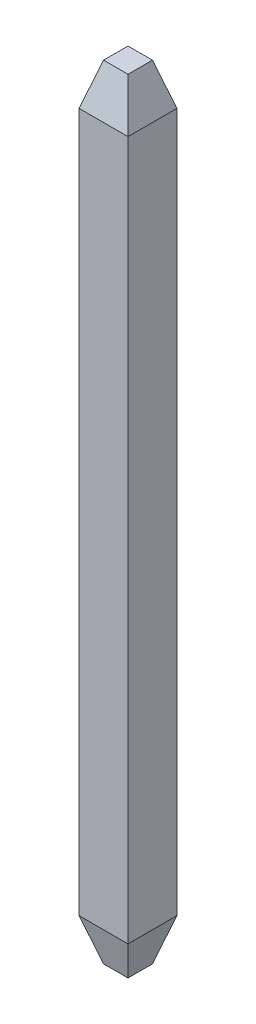
ISO-10303-21;
HEADER;
FILE_DESCRIPTION(('STEP AP214'),'2;1');
FILE_NAME('part.step','',(''),(''),'','','');
FILE_SCHEMA(('AUTOMOTIVE_DESIGN { 1 0 10303 214 1 1 1 1 }'));
ENDSEC;
DATA;
#1=APPLICATION_CONTEXT('core data for automotive mechanical design processes');
#2=APPLICATION_PROTOCOL_DEFINITION('international standard','automotive_design',2000,#1);
#3=PRODUCT_CONTEXT('',#1,'mechanical');
#4=PRODUCT('Part','Part','',(#3));
#5=PRODUCT_RELATED_PRODUCT_CATEGORY('part','',(#4));
#6=PRODUCT_DEFINITION_FORMATION('','',#4);
#7=PRODUCT_DEFINITION_CONTEXT('part definition',#1,'design');
#8=PRODUCT_DEFINITION('design','',#6,#7);
#9=PRODUCT_DEFINITION_SHAPE('','',#8);
#10=(LENGTH_UNIT() NAMED_UNIT(*) SI_UNIT(.MILLI.,.METRE.));
#11=(NAMED_UNIT(*) PLANE_ANGLE_UNIT() SI_UNIT($,.RADIAN.));
#12=(NAMED_UNIT(*) SI_UNIT($,.STERADIAN.) SOLID_ANGLE_UNIT());
#13=UNCERTAINTY_MEASURE_WITH_UNIT(LENGTH_MEASURE(1.E-05),#10,'distance_accuracy_value','');
#14=(GEOMETRIC_REPRESENTATION_CONTEXT(3) GLOBAL_UNCERTAINTY_ASSIGNED_CONTEXT((#13)) GLOBAL_UNIT_ASSIGNED_CONTEXT((#10,
#11,#12)) REPRESENTATION_CONTEXT('',''));
#15=CARTESIAN_POINT('',(0.,0.,0.));
#16=DIRECTION('',(0.,0.,1.));
#17=DIRECTION('',(1.,0.,0.));
#18=AXIS2_PLACEMENT_3D('',#15,#16,#17);
#19=CARTESIAN_POINT('',(-21.429999999987,-10.1039999999832,-19.1999999999763));
#20=DIRECTION('',(0.,-0.281214622974643,0.959644900900968));
#21=DIRECTION('',(-1.,0.,0.));
#22=AXIS2_PLACEMENT_3D('',#19,#20,#21);
#23=PLANE('',#22);
#24=DIRECTION('',(-1.,0.,0.));
#25=VECTOR('',#24,1.);
#26=CARTESIAN_POINT('',(-21.109999999987,-10.1039999999832,-19.1999999999763));
#27=LINE('',#26,#25);
#28=CARTESIAN_POINT('',(-21.109999999987,-10.1039999999832,-19.1999999999763));
#29=VERTEX_POINT('',#28);
#30=CARTESIAN_POINT('',(-21.749999999987,-10.1039999999832,-19.1999999999763));
#31=VERTEX_POINT('',#30);
#32=EDGE_CURVE('E11',#29,#31,#27,.T.);
#33=ORIENTED_EDGE('',*,*,#32,.T.);
#34=DIRECTION('',(0.270714017147727,-0.923811583516618,-0.270714017147727));
#35=VECTOR('',#34,1.);
#36=CARTESIAN_POINT('',(-21.749999999987,-10.1039999999832,-19.1999999999763));
#37=LINE('',#36,#35);
#38=CARTESIAN_POINT('',(-21.589999999987,-10.6499999999832,-19.3599999999763));
#39=VERTEX_POINT('',#38);
#40=EDGE_CURVE('E27',#31,#39,#37,.T.);
#41=ORIENTED_EDGE('',*,*,#40,.T.);
#42=DIRECTION('',(-1.,0.,0.));
#43=VECTOR('',#42,1.);
#44=CARTESIAN_POINT('',(-21.269999999987,-10.6499999999832,-19.3599999999763));
#45=LINE('',#44,#43);
#46=CARTESIAN_POINT('',(-21.269999999987,-10.6499999999832,-19.3599999999763));
#47=VERTEX_POINT('',#46);
#48=EDGE_CURVE('E189',#47,#39,#45,.T.);
#49=ORIENTED_EDGE('',*,*,#48,.F.);
#50=DIRECTION('',(-0.270714017147727,-0.923811583516618,-0.270714017147727));
#51=VECTOR('',#50,1.);
#52=CARTESIAN_POINT('',(-21.109999999987,-10.1039999999832,-19.1999999999763));
#53=LINE('',#52,#51);
#54=EDGE_CURVE('E96',#29,#47,#53,.T.);
#55=ORIENTED_EDGE('',*,*,#54,.F.);
#56=EDGE_LOOP('',(#33,#41,#49,#55));
#57=FACE_BOUND('',#56,.T.);
#58=ADVANCED_FACE('F17',(#57),#23,.T.);
#59=CARTESIAN_POINT('',(-21.750999999987,-5.53543505344796,-19.1999999999763));
#60=DIRECTION('',(0.,0.,1.));
#61=DIRECTION('',(1.,0.,0.));
#62=AXIS2_PLACEMENT_3D('',#59,#60,#61);
#63=PLANE('',#62);
#64=DIRECTION('',(0.,1.,0.));
#65=VECTOR('',#64,1.);
#66=CARTESIAN_POINT('',(-21.749999999987,-10.1039999999832,-19.1999999999763));
#67=LINE('',#66,#65);
#68=CARTESIAN_POINT('',(-21.749999999987,-0.965870106912723,-19.1999999999763));
#69=VERTEX_POINT('',#68);
#70=EDGE_CURVE('E41',#31,#69,#67,.T.);
#71=ORIENTED_EDGE('',*,*,#70,.F.);
#72=ORIENTED_EDGE('',*,*,#32,.F.);
#73=DIRECTION('',(0.,1.,0.));
#74=VECTOR('',#73,1.);
#75=CARTESIAN_POINT('',(-21.109999999987,-10.1039999999832,-19.1999999999763));
#76=LINE('',#75,#74);
#77=CARTESIAN_POINT('',(-21.109999999987,-0.965870106912723,-19.1999999999763));
#78=VERTEX_POINT('',#77);
#79=EDGE_CURVE('E127',#29,#78,#76,.T.);
#80=ORIENTED_EDGE('',*,*,#79,.T.);
#81=DIRECTION('',(-1.,0.,0.));
#82=VECTOR('',#81,1.);
#83=CARTESIAN_POINT('',(-21.109999999987,-0.965870106912721,-19.1999999999763));
#84=LINE('',#83,#82);
#85=EDGE_CURVE('E121',#78,#69,#84,.T.);
#86=ORIENTED_EDGE('',*,*,#85,.T.);
#87=EDGE_LOOP('',(#71,#72,#80,#86));
#88=FACE_BOUND('',#87,.T.);
#89=ADVANCED_FACE('F129',(#88),#63,.T.);
#90=CARTESIAN_POINT('',(-21.749999999987,-5.53543505344796,-19.1989999999763));
#91=DIRECTION('',(-1.,0.,0.));
#92=DIRECTION('',(0.,0.,1.));
#93=AXIS2_PLACEMENT_3D('',#90,#91,#92);
#94=PLANE('',#93);
#95=DIRECTION('',(0.,1.,0.));
#96=VECTOR('',#95,1.);
#97=CARTESIAN_POINT('',(-21.749999999987,-10.1039999999832,-19.8399999999763));
#98=LINE('',#97,#96);
#99=CARTESIAN_POINT('',(-21.749999999987,-10.1039999999832,-19.8399999999763));
#100=VERTEX_POINT('',#99);
#101=CARTESIAN_POINT('',(-21.749999999987,-0.965870106912723,-19.8399999999763));
#102=VERTEX_POINT('',#101);
#103=EDGE_CURVE('E177',#100,#102,#98,.T.);
#104=ORIENTED_EDGE('',*,*,#103,.F.);
#105=DIRECTION('',(0.,0.,-1.));
#106=VECTOR('',#105,1.);
#107=CARTESIAN_POINT('',(-21.749999999987,-10.1039999999832,-19.1999999999763));
#108=LINE('',#107,#106);
#109=EDGE_CURVE('E20',#31,#100,#108,.T.);
#110=ORIENTED_EDGE('',*,*,#109,.F.);
#111=ORIENTED_EDGE('',*,*,#70,.T.);
#112=DIRECTION('',(0.,0.,-1.));
#113=VECTOR('',#112,1.);
#114=CARTESIAN_POINT('',(-21.749999999987,-0.965870106912721,-19.1999999999763));
#115=LINE('',#114,#113);
#116=EDGE_CURVE('E165',#69,#102,#115,.T.);
#117=ORIENTED_EDGE('',*,*,#116,.T.);
#118=EDGE_LOOP('',(#104,#110,#111,#117));
#119=FACE_BOUND('',#118,.T.);
#120=ADVANCED_FACE('F219',(#119),#94,.T.);
#121=CARTESIAN_POINT('',(-21.108999999987,-5.53443505344796,-19.8399999999763));
#122=DIRECTION('',(0.,0.,-1.));
#123=DIRECTION('',(0.,-1.,0.));
#124=AXIS2_PLACEMENT_3D('',#121,#122,#123);
#125=PLANE('',#124);
#126=DIRECTION('',(0.,1.,0.));
#127=VECTOR('',#126,1.);
#128=CARTESIAN_POINT('',(-21.109999999987,-10.1039999999832,-19.8399999999763));
#129=LINE('',#128,#127);
#130=CARTESIAN_POINT('',(-21.109999999987,-10.1039999999832,-19.8399999999763));
#131=VERTEX_POINT('',#130);
#132=CARTESIAN_POINT('',(-21.109999999987,-0.965870106912723,-19.8399999999763));
#133=VERTEX_POINT('',#132);
#134=EDGE_CURVE('E136',#131,#133,#129,.T.);
#135=ORIENTED_EDGE('',*,*,#134,.F.);
#136=DIRECTION('',(1.,0.,0.));
#137=VECTOR('',#136,1.);
#138=CARTESIAN_POINT('',(-21.749999999987,-10.1039999999832,-19.8399999999763));
#139=LINE('',#138,#137);
#140=EDGE_CURVE('E173',#100,#131,#139,.T.);
#141=ORIENTED_EDGE('',*,*,#140,.F.);
#142=ORIENTED_EDGE('',*,*,#103,.T.);
#143=DIRECTION('',(1.,0.,0.));
#144=VECTOR('',#143,1.);
#145=CARTESIAN_POINT('',(-21.749999999987,-0.965870106912721,-19.8399999999763));
#146=LINE('',#145,#144);
#147=EDGE_CURVE('E180',#102,#133,#146,.T.);
#148=ORIENTED_EDGE('',*,*,#147,.T.);
#149=EDGE_LOOP('',(#135,#141,#142,#148));
#150=FACE_BOUND('',#149,.T.);
#151=ADVANCED_FACE('F384',(#150),#125,.T.);
#152=CARTESIAN_POINT('',(-21.429999999987,-0.965870106912721,-19.8399999999763));
#153=DIRECTION('',(0.,0.281214622974643,-0.959644900900968));
#154=DIRECTION('',(-1.,0.,0.));
#155=AXIS2_PLACEMENT_3D('',#152,#153,#154);
#156=PLANE('',#155);
#157=DIRECTION('',(0.270714017147727,0.923811583516617,0.270714017147727));
#158=VECTOR('',#157,1.);
#159=CARTESIAN_POINT('',(-21.749999999987,-0.965870106912721,-19.8399999999763));
#160=LINE('',#159,#158);
#161=CARTESIAN_POINT('',(-21.589999999987,-0.419870106912724,-19.6799999999763));
#162=VERTEX_POINT('',#161);
#163=EDGE_CURVE('E182',#102,#162,#160,.T.);
#164=ORIENTED_EDGE('',*,*,#163,.T.);
#165=DIRECTION('',(1.,0.,0.));
#166=VECTOR('',#165,1.);
#167=CARTESIAN_POINT('',(-21.589999999987,-0.419870106912722,-19.6799999999763));
#168=LINE('',#167,#166);
#169=CARTESIAN_POINT('',(-21.269999999987,-0.419870106912724,-19.6799999999763));
#170=VERTEX_POINT('',#169);
#171=EDGE_CURVE('E157',#162,#170,#168,.T.);
#172=ORIENTED_EDGE('',*,*,#171,.T.);
#173=DIRECTION('',(-0.270714017147727,0.923811583516617,0.270714017147727));
#174=VECTOR('',#173,1.);
#175=CARTESIAN_POINT('',(-21.109999999987,-0.965870106912721,-19.8399999999763));
#176=LINE('',#175,#174);
#177=EDGE_CURVE('E196',#133,#170,#176,.T.);
#178=ORIENTED_EDGE('',*,*,#177,.F.);
#179=ORIENTED_EDGE('',*,*,#147,.F.);
#180=EDGE_LOOP('',(#164,#172,#178,#179));
#181=FACE_BOUND('',#180,.T.);
#182=ADVANCED_FACE('F376',(#181),#156,.T.);
#183=CARTESIAN_POINT('',(-21.109999999987,-0.965870106912721,-19.5199999999763));
#184=DIRECTION('',(0.959644900900968,0.281214622974643,0.));
#185=DIRECTION('',(0.,0.,-1.));
#186=AXIS2_PLACEMENT_3D('',#183,#184,#185);
#187=PLANE('',#186);
#188=ORIENTED_EDGE('',*,*,#177,.T.);
#189=DIRECTION('',(0.,0.,1.));
#190=VECTOR('',#189,1.);
#191=CARTESIAN_POINT('',(-21.269999999987,-0.419870106912722,-19.6799999999763));
#192=LINE('',#191,#190);
#193=CARTESIAN_POINT('',(-21.269999999987,-0.419870106912724,-19.3599999999763));
#194=VERTEX_POINT('',#193);
#195=EDGE_CURVE('E113',#170,#194,#192,.T.);
#196=ORIENTED_EDGE('',*,*,#195,.T.);
#197=DIRECTION('',(-0.270714017147727,0.923811583516617,-0.270714017147727));
#198=VECTOR('',#197,1.);
#199=CARTESIAN_POINT('',(-21.109999999987,-0.965870106912721,-19.1999999999763));
#200=LINE('',#199,#198);
#201=EDGE_CURVE('E106',#78,#194,#200,.T.);
#202=ORIENTED_EDGE('',*,*,#201,.F.);
#203=DIRECTION('',(0.,0.,1.));
#204=VECTOR('',#203,1.);
#205=CARTESIAN_POINT('',(-21.109999999987,-0.965870106912721,-19.8399999999763));
#206=LINE('',#205,#204);
#207=EDGE_CURVE('E111',#133,#78,#206,.T.);
#208=ORIENTED_EDGE('',*,*,#207,.F.);
#209=EDGE_LOOP('',(#188,#196,#202,#208));
#210=FACE_BOUND('',#209,.T.);
#211=ADVANCED_FACE('F109',(#210),#187,.T.);
#212=CARTESIAN_POINT('',(-21.429999999987,-0.419870106912722,-19.6809999999763));
#213=DIRECTION('',(0.,1.,0.));
#214=DIRECTION('',(1.,0.,0.));
#215=AXIS2_PLACEMENT_3D('',#212,#213,#214);
#216=PLANE('',#215);
#217=ORIENTED_EDGE('',*,*,#171,.F.);
#218=DIRECTION('',(0.,0.,-1.));
#219=VECTOR('',#218,1.);
#220=CARTESIAN_POINT('',(-21.589999999987,-0.419870106912722,-19.3599999999763));
#221=LINE('',#220,#219);
#222=CARTESIAN_POINT('',(-21.589999999987,-0.419870106912724,-19.3599999999763));
#223=VERTEX_POINT('',#222);
#224=EDGE_CURVE('E117',#223,#162,#221,.T.);
#225=ORIENTED_EDGE('',*,*,#224,.F.);
#226=DIRECTION('',(-1.,0.,0.));
#227=VECTOR('',#226,1.);
#228=CARTESIAN_POINT('',(-21.269999999987,-0.419870106912722,-19.3599999999763));
#229=LINE('',#228,#227);
#230=EDGE_CURVE('E118',#194,#223,#229,.T.);
#231=ORIENTED_EDGE('',*,*,#230,.F.);
#232=ORIENTED_EDGE('',*,*,#195,.F.);
#233=EDGE_LOOP('',(#217,#225,#231,#232));
#234=FACE_BOUND('',#233,.T.);
#235=ADVANCED_FACE('F155',(#234),#216,.T.);
#236=CARTESIAN_POINT('',(-21.429999999987,-10.1039999999832,-19.8399999999763));
#237=DIRECTION('',(0.,-0.281214622974643,-0.959644900900968));
#238=DIRECTION('',(0.,-0.959644900900968,0.281214622974643));
#239=AXIS2_PLACEMENT_3D('',#236,#237,#238);
#240=PLANE('',#239);
#241=ORIENTED_EDGE('',*,*,#140,.T.);
#242=DIRECTION('',(-0.270714017147727,-0.923811583516618,0.270714017147727));
#243=VECTOR('',#242,1.);
#244=CARTESIAN_POINT('',(-21.109999999987,-10.1039999999832,-19.8399999999763));
#245=LINE('',#244,#243);
#246=CARTESIAN_POINT('',(-21.269999999987,-10.6499999999832,-19.6799999999763));
#247=VERTEX_POINT('',#246);
#248=EDGE_CURVE('E167',#131,#247,#245,.T.);
#249=ORIENTED_EDGE('',*,*,#248,.T.);
#250=DIRECTION('',(1.,0.,0.));
#251=VECTOR('',#250,1.);
#252=CARTESIAN_POINT('',(-21.589999999987,-10.6499999999832,-19.6799999999763));
#253=LINE('',#252,#251);
#254=CARTESIAN_POINT('',(-21.589999999987,-10.6499999999832,-19.6799999999763));
#255=VERTEX_POINT('',#254);
#256=EDGE_CURVE('E185',#255,#247,#253,.T.);
#257=ORIENTED_EDGE('',*,*,#256,.F.);
#258=DIRECTION('',(0.270714017147727,-0.923811583516618,0.270714017147727));
#259=VECTOR('',#258,1.);
#260=CARTESIAN_POINT('',(-21.749999999987,-10.1039999999832,-19.8399999999763));
#261=LINE('',#260,#259);
#262=EDGE_CURVE('E206',#100,#255,#261,.T.);
#263=ORIENTED_EDGE('',*,*,#262,.F.);
#264=EDGE_LOOP('',(#241,#249,#257,#263));
#265=FACE_BOUND('',#264,.T.);
#266=ADVANCED_FACE('F349',(#265),#240,.T.);
#267=CARTESIAN_POINT('',(-21.749999999987,-0.965870106912721,-19.5199999999763));
#268=DIRECTION('',(-0.959644900900968,0.281214622974643,0.));
#269=DIRECTION('',(0.,0.,1.));
#270=AXIS2_PLACEMENT_3D('',#267,#268,#269);
#271=PLANE('',#270);
#272=DIRECTION('',(0.270714017147727,0.923811583516617,-0.270714017147727));
#273=VECTOR('',#272,1.);
#274=CARTESIAN_POINT('',(-21.749999999987,-0.965870106912721,-19.1999999999763));
#275=LINE('',#274,#273);
#276=EDGE_CURVE('E125',#69,#223,#275,.T.);
#277=ORIENTED_EDGE('',*,*,#276,.T.);
#278=ORIENTED_EDGE('',*,*,#224,.T.);
#279=ORIENTED_EDGE('',*,*,#163,.F.);
#280=ORIENTED_EDGE('',*,*,#116,.F.);
#281=EDGE_LOOP('',(#277,#278,#279,#280));
#282=FACE_BOUND('',#281,.T.);
#283=ADVANCED_FACE('F163',(#282),#271,.T.);
#284=CARTESIAN_POINT('',(-21.429999999987,-0.965870106912721,-19.1999999999763));
#285=DIRECTION('',(0.,0.281214622974643,0.959644900900968));
#286=DIRECTION('',(1.,0.,0.));
#287=AXIS2_PLACEMENT_3D('',#284,#285,#286);
#288=PLANE('',#287);
#289=ORIENTED_EDGE('',*,*,#201,.T.);
#290=ORIENTED_EDGE('',*,*,#230,.T.);
#291=ORIENTED_EDGE('',*,*,#276,.F.);
#292=ORIENTED_EDGE('',*,*,#85,.F.);
#293=EDGE_LOOP('',(#289,#290,#291,#292));
#294=FACE_BOUND('',#293,.T.);
#295=ADVANCED_FACE('F123',(#294),#288,.T.);
#296=CARTESIAN_POINT('',(-21.109999999987,-11.0738701069127,-19.5199999999763));
#297=DIRECTION('',(1.,0.,0.));
#298=DIRECTION('',(0.,1.,0.));
#299=AXIS2_PLACEMENT_3D('',#296,#297,#298);
#300=PLANE('',#299);
#301=ORIENTED_EDGE('',*,*,#79,.F.);
#302=DIRECTION('',(0.,0.,1.));
#303=VECTOR('',#302,1.);
#304=CARTESIAN_POINT('',(-21.109999999987,-10.1039999999832,-19.8399999999763));
#305=LINE('',#304,#303);
#306=EDGE_CURVE('E139',#131,#29,#305,.T.);
#307=ORIENTED_EDGE('',*,*,#306,.F.);
#308=ORIENTED_EDGE('',*,*,#134,.T.);
#309=ORIENTED_EDGE('',*,*,#207,.T.);
#310=EDGE_LOOP('',(#301,#307,#308,#309));
#311=FACE_BOUND('',#310,.T.);
#312=ADVANCED_FACE('F135',(#311),#300,.T.);
#313=CARTESIAN_POINT('',(-21.109999999987,-10.1039999999832,-19.5199999999763));
#314=DIRECTION('',(0.959644900900968,-0.281214622974643,0.));
#315=DIRECTION('',(0.,0.,-1.));
#316=AXIS2_PLACEMENT_3D('',#313,#314,#315);
#317=PLANE('',#316);
#318=ORIENTED_EDGE('',*,*,#306,.T.);
#319=ORIENTED_EDGE('',*,*,#54,.T.);
#320=DIRECTION('',(0.,0.,1.));
#321=VECTOR('',#320,1.);
#322=CARTESIAN_POINT('',(-21.269999999987,-10.6499999999832,-19.6799999999763));
#323=LINE('',#322,#321);
#324=EDGE_CURVE('E192',#247,#47,#323,.T.);
#325=ORIENTED_EDGE('',*,*,#324,.F.);
#326=ORIENTED_EDGE('',*,*,#248,.F.);
#327=EDGE_LOOP('',(#318,#319,#325,#326));
#328=FACE_BOUND('',#327,.T.);
#329=ADVANCED_FACE('F312',(#328),#317,.T.);
#330=CARTESIAN_POINT('',(-21.590999999987,-10.6499999999832,-19.5199999999763));
#331=DIRECTION('',(0.,-1.,0.));
#332=DIRECTION('',(0.,0.,-1.));
#333=AXIS2_PLACEMENT_3D('',#330,#331,#332);
#334=PLANE('',#333);
#335=ORIENTED_EDGE('',*,*,#324,.T.);
#336=ORIENTED_EDGE('',*,*,#48,.T.);
#337=DIRECTION('',(0.,0.,-1.));
#338=VECTOR('',#337,1.);
#339=CARTESIAN_POINT('',(-21.589999999987,-10.6499999999832,-19.3599999999763));
#340=LINE('',#339,#338);
#341=EDGE_CURVE('E188',#39,#255,#340,.T.);
#342=ORIENTED_EDGE('',*,*,#341,.T.);
#343=ORIENTED_EDGE('',*,*,#256,.T.);
#344=EDGE_LOOP('',(#335,#336,#342,#343));
#345=FACE_BOUND('',#344,.T.);
#346=ADVANCED_FACE('F301',(#345),#334,.T.);
#347=CARTESIAN_POINT('',(-21.749999999987,-10.1039999999832,-19.5199999999763));
#348=DIRECTION('',(-0.959644900900968,-0.281214622974643,0.));
#349=DIRECTION('',(-0.281214622974643,0.959644900900968,0.));
#350=AXIS2_PLACEMENT_3D('',#347,#348,#349);
#351=PLANE('',#350);
#352=ORIENTED_EDGE('',*,*,#109,.T.);
#353=ORIENTED_EDGE('',*,*,#262,.T.);
#354=ORIENTED_EDGE('',*,*,#341,.F.);
#355=ORIENTED_EDGE('',*,*,#40,.F.);
#356=EDGE_LOOP('',(#352,#353,#354,#355));
#357=FACE_BOUND('',#356,.T.);
#358=ADVANCED_FACE('F296',(#357),#351,.T.);
#359=CLOSED_SHELL('',(#58,#89,#120,#151,#182,#211,#235,#266,#283,#295,#312,#329,#346,#358));
#360=MANIFOLD_SOLID_BREP('B1',#359);
#361=ADVANCED_BREP_SHAPE_REPRESENTATION('',(#18,#360),#14);
#362=SHAPE_DEFINITION_REPRESENTATION(#9,#361);
ENDSEC;
END-ISO-10303-21;
